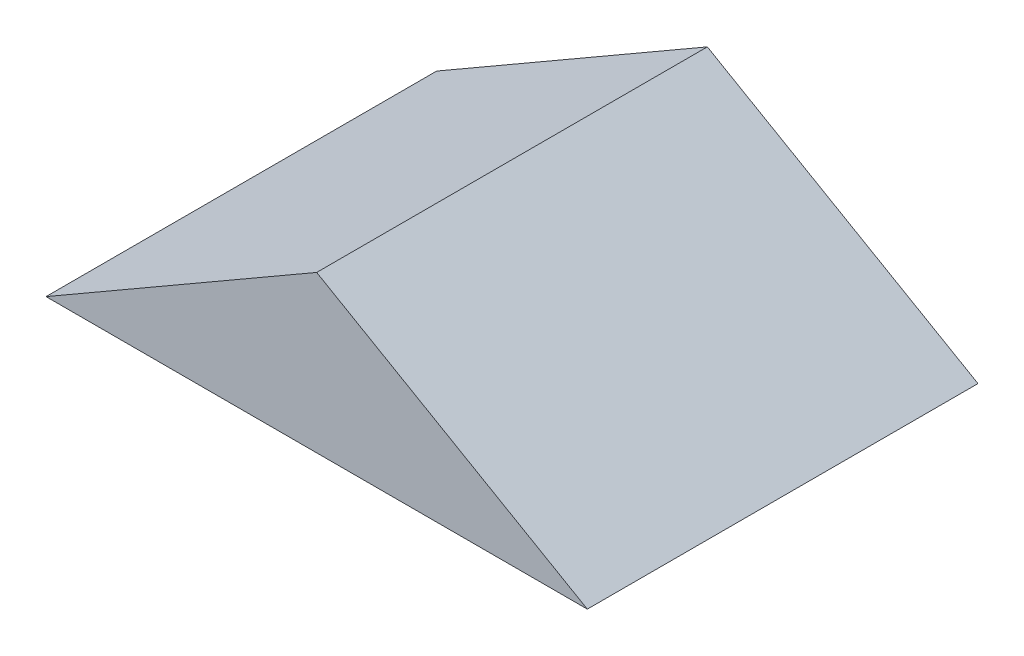
ISO-10303-21;
HEADER;
FILE_DESCRIPTION(('STEP AP214'),'2;1');
FILE_NAME('part.step','',(''),(''),'','','');
FILE_SCHEMA(('AUTOMOTIVE_DESIGN { 1 0 10303 214 1 1 1 1 }'));
ENDSEC;
DATA;
#1=APPLICATION_CONTEXT('core data for automotive mechanical design processes');
#2=APPLICATION_PROTOCOL_DEFINITION('international standard','automotive_design',2000,#1);
#3=PRODUCT_CONTEXT('',#1,'mechanical');
#4=PRODUCT('Part','Part','',(#3));
#5=PRODUCT_RELATED_PRODUCT_CATEGORY('part','',(#4));
#6=PRODUCT_DEFINITION_FORMATION('','',#4);
#7=PRODUCT_DEFINITION_CONTEXT('part definition',#1,'design');
#8=PRODUCT_DEFINITION('design','',#6,#7);
#9=PRODUCT_DEFINITION_SHAPE('','',#8);
#10=(LENGTH_UNIT() NAMED_UNIT(*) SI_UNIT(.MILLI.,.METRE.));
#11=(NAMED_UNIT(*) PLANE_ANGLE_UNIT() SI_UNIT($,.RADIAN.));
#12=(NAMED_UNIT(*) SI_UNIT($,.STERADIAN.) SOLID_ANGLE_UNIT());
#13=UNCERTAINTY_MEASURE_WITH_UNIT(LENGTH_MEASURE(1.E-05),#10,'distance_accuracy_value','');
#14=(GEOMETRIC_REPRESENTATION_CONTEXT(3) GLOBAL_UNCERTAINTY_ASSIGNED_CONTEXT((#13)) GLOBAL_UNIT_ASSIGNED_CONTEXT((#10,
#11,#12)) REPRESENTATION_CONTEXT('',''));
#15=CARTESIAN_POINT('',(0.,0.,0.));
#16=DIRECTION('',(0.,0.,1.));
#17=DIRECTION('',(1.,0.,0.));
#18=AXIS2_PLACEMENT_3D('',#15,#16,#17);
#19=CARTESIAN_POINT('',(8.79881810245001,0.,12.7));
#20=DIRECTION('',(-0.499999999999995,-0.866025403784441,0.));
#21=DIRECTION('',(0.866025403784441,-0.499999999999995,0.));
#22=AXIS2_PLACEMENT_3D('',#19,#20,#21);
#23=PLANE('',#22);
#24=DIRECTION('',(-0.866025403784441,0.499999999999995,0.));
#25=VECTOR('',#24,1.);
#26=CARTESIAN_POINT('',(8.79881810245001,0.,0.));
#27=LINE('',#26,#25);
#28=CARTESIAN_POINT('',(8.79881810245001,0.,0.));
#29=VERTEX_POINT('',#28);
#30=CARTESIAN_POINT('',(0.,5.08,0.));
#31=VERTEX_POINT('',#30);
#32=EDGE_CURVE('E80',#29,#31,#27,.T.);
#33=ORIENTED_EDGE('',*,*,#32,.T.);
#34=DIRECTION('',(0.,0.,-1.));
#35=VECTOR('',#34,1.);
#36=CARTESIAN_POINT('',(0.,5.08,12.7));
#37=LINE('',#36,#35);
#38=CARTESIAN_POINT('',(0.,5.08,12.7));
#39=VERTEX_POINT('',#38);
#40=EDGE_CURVE('E11',#39,#31,#37,.T.);
#41=ORIENTED_EDGE('',*,*,#40,.F.);
#42=DIRECTION('',(-0.866025403784441,0.499999999999995,0.));
#43=VECTOR('',#42,1.);
#44=CARTESIAN_POINT('',(8.79881810245001,0.,12.7));
#45=LINE('',#44,#43);
#46=CARTESIAN_POINT('',(8.79881810245001,0.,12.7));
#47=VERTEX_POINT('',#46);
#48=EDGE_CURVE('E73',#47,#39,#45,.T.);
#49=ORIENTED_EDGE('',*,*,#48,.F.);
#50=DIRECTION('',(0.,0.,-1.));
#51=VECTOR('',#50,1.);
#52=CARTESIAN_POINT('',(8.79881810245001,0.,12.7));
#53=LINE('',#52,#51);
#54=EDGE_CURVE('E81',#47,#29,#53,.T.);
#55=ORIENTED_EDGE('',*,*,#54,.T.);
#56=EDGE_LOOP('',(#33,#41,#49,#55));
#57=FACE_BOUND('',#56,.T.);
#58=ADVANCED_FACE('F33',(#57),#23,.F.);
#59=CARTESIAN_POINT('',(0.,5.08,12.7));
#60=DIRECTION('',(0.499999999999995,-0.866025403784441,0.));
#61=DIRECTION('',(0.866025403784441,0.499999999999995,0.));
#62=AXIS2_PLACEMENT_3D('',#59,#60,#61);
#63=PLANE('',#62);
#64=DIRECTION('',(-0.866025403784441,-0.499999999999995,0.));
#65=VECTOR('',#64,1.);
#66=CARTESIAN_POINT('',(0.,5.08,0.));
#67=LINE('',#66,#65);
#68=CARTESIAN_POINT('',(-8.79881810245001,0.,0.));
#69=VERTEX_POINT('',#68);
#70=EDGE_CURVE('E61',#31,#69,#67,.T.);
#71=ORIENTED_EDGE('',*,*,#70,.T.);
#72=DIRECTION('',(0.,0.,-1.));
#73=VECTOR('',#72,1.);
#74=CARTESIAN_POINT('',(-8.79881810245001,0.,12.7));
#75=LINE('',#74,#73);
#76=CARTESIAN_POINT('',(-8.79881810245001,0.,12.7));
#77=VERTEX_POINT('',#76);
#78=EDGE_CURVE('E41',#77,#69,#75,.T.);
#79=ORIENTED_EDGE('',*,*,#78,.F.);
#80=DIRECTION('',(-0.866025403784441,-0.499999999999995,0.));
#81=VECTOR('',#80,1.);
#82=CARTESIAN_POINT('',(0.,5.08,12.7));
#83=LINE('',#82,#81);
#84=EDGE_CURVE('E69',#39,#77,#83,.T.);
#85=ORIENTED_EDGE('',*,*,#84,.F.);
#86=ORIENTED_EDGE('',*,*,#40,.T.);
#87=EDGE_LOOP('',(#71,#79,#85,#86));
#88=FACE_BOUND('',#87,.T.);
#89=ADVANCED_FACE('F70',(#88),#63,.F.);
#90=CARTESIAN_POINT('',(-8.79881810245001,0.,12.7));
#91=DIRECTION('',(0.,1.,0.));
#92=DIRECTION('',(0.,0.,1.));
#93=AXIS2_PLACEMENT_3D('',#90,#91,#92);
#94=PLANE('',#93);
#95=DIRECTION('',(1.,0.,0.));
#96=VECTOR('',#95,1.);
#97=CARTESIAN_POINT('',(-8.79881810245001,0.,0.));
#98=LINE('',#97,#96);
#99=EDGE_CURVE('E66',#69,#29,#98,.T.);
#100=ORIENTED_EDGE('',*,*,#99,.T.);
#101=ORIENTED_EDGE('',*,*,#54,.F.);
#102=DIRECTION('',(1.,0.,0.));
#103=VECTOR('',#102,1.);
#104=CARTESIAN_POINT('',(-8.79881810245001,0.,12.7));
#105=LINE('',#104,#103);
#106=EDGE_CURVE('E49',#77,#47,#105,.T.);
#107=ORIENTED_EDGE('',*,*,#106,.F.);
#108=ORIENTED_EDGE('',*,*,#78,.T.);
#109=EDGE_LOOP('',(#100,#101,#107,#108));
#110=FACE_BOUND('',#109,.T.);
#111=ADVANCED_FACE('F88',(#110),#94,.F.);
#112=CARTESIAN_POINT('',(0.,0.,12.7));
#113=DIRECTION('',(0.,0.,1.));
#114=DIRECTION('',(1.,0.,0.));
#115=AXIS2_PLACEMENT_3D('',#112,#113,#114);
#116=PLANE('',#115);
#117=ORIENTED_EDGE('',*,*,#48,.T.);
#118=ORIENTED_EDGE('',*,*,#84,.T.);
#119=ORIENTED_EDGE('',*,*,#106,.T.);
#120=EDGE_LOOP('',(#117,#118,#119));
#121=FACE_BOUND('',#120,.T.);
#122=ADVANCED_FACE('F76',(#121),#116,.T.);
#123=CARTESIAN_POINT('',(0.,0.,0.));
#124=DIRECTION('',(0.,0.,1.));
#125=DIRECTION('',(1.,0.,0.));
#126=AXIS2_PLACEMENT_3D('',#123,#124,#125);
#127=PLANE('',#126);
#128=ORIENTED_EDGE('',*,*,#32,.F.);
#129=ORIENTED_EDGE('',*,*,#99,.F.);
#130=ORIENTED_EDGE('',*,*,#70,.F.);
#131=EDGE_LOOP('',(#128,#129,#130));
#132=FACE_BOUND('',#131,.T.);
#133=ADVANCED_FACE('F89',(#132),#127,.F.);
#134=CLOSED_SHELL('',(#58,#89,#111,#122,#133));
#135=MANIFOLD_SOLID_BREP('B2',#134);
#136=ADVANCED_BREP_SHAPE_REPRESENTATION('',(#18,#135),#14);
#137=SHAPE_DEFINITION_REPRESENTATION(#9,#136);
ENDSEC;
END-ISO-10303-21;
